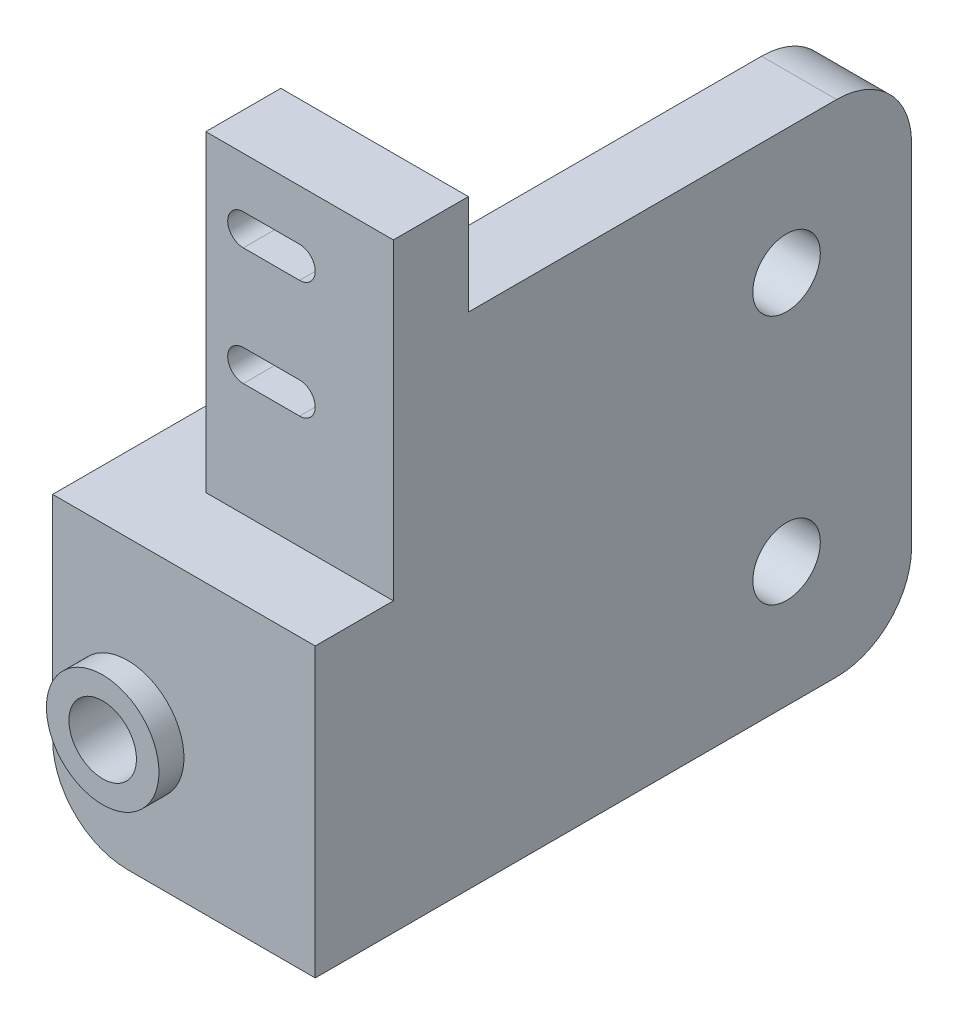
ISO-10303-21;
HEADER;
FILE_DESCRIPTION(('STEP AP214'),'2;1');
FILE_NAME('part.step','',(''),(''),'','','');
FILE_SCHEMA(('AUTOMOTIVE_DESIGN { 1 0 10303 214 1 1 1 1 }'));
ENDSEC;
DATA;
#1=APPLICATION_CONTEXT('core data for automotive mechanical design processes');
#2=APPLICATION_PROTOCOL_DEFINITION('international standard','automotive_design',2000,#1);
#3=PRODUCT_CONTEXT('',#1,'mechanical');
#4=PRODUCT('Part','Part','',(#3));
#5=PRODUCT_RELATED_PRODUCT_CATEGORY('part','',(#4));
#6=PRODUCT_DEFINITION_FORMATION('','',#4);
#7=PRODUCT_DEFINITION_CONTEXT('part definition',#1,'design');
#8=PRODUCT_DEFINITION('design','',#6,#7);
#9=PRODUCT_DEFINITION_SHAPE('','',#8);
#10=(LENGTH_UNIT() NAMED_UNIT(*) SI_UNIT(.MILLI.,.METRE.));
#11=(NAMED_UNIT(*) PLANE_ANGLE_UNIT() SI_UNIT($,.RADIAN.));
#12=(NAMED_UNIT(*) SI_UNIT($,.STERADIAN.) SOLID_ANGLE_UNIT());
#13=UNCERTAINTY_MEASURE_WITH_UNIT(LENGTH_MEASURE(1.E-05),#10,'distance_accuracy_value','');
#14=(GEOMETRIC_REPRESENTATION_CONTEXT(3) GLOBAL_UNCERTAINTY_ASSIGNED_CONTEXT((#13)) GLOBAL_UNIT_ASSIGNED_CONTEXT((#10,
#11,#12)) REPRESENTATION_CONTEXT('',''));
#15=CARTESIAN_POINT('',(0.,0.,0.));
#16=DIRECTION('',(0.,0.,1.));
#17=DIRECTION('',(1.,0.,0.));
#18=AXIS2_PLACEMENT_3D('',#15,#16,#17);
#19=CARTESIAN_POINT('',(0.,0.,0.));
#20=DIRECTION('',(1.,0.,0.));
#21=DIRECTION('',(0.,0.,-1.));
#22=AXIS2_PLACEMENT_3D('',#19,#20,#21);
#23=PLANE('',#22);
#24=CARTESIAN_POINT('',(0.,10.,-33.15));
#25=DIRECTION('',(1.,0.,0.));
#26=DIRECTION('',(0.,0.,-1.));
#27=AXIS2_PLACEMENT_3D('',#24,#25,#26);
#28=CIRCLE('',#27,2.7);
#29=CARTESIAN_POINT('',(0.,10.,-35.85));
#30=VERTEX_POINT('',#29);
#31=EDGE_CURVE('E382',#30,#30,#28,.F.);
#32=ORIENTED_EDGE('',*,*,#31,.T.);
#33=EDGE_LOOP('',(#32));
#34=FACE_BOUND('',#33,.T.);
#35=CARTESIAN_POINT('',(0.,6.,-37.15));
#36=DIRECTION('',(1.,0.,0.));
#37=DIRECTION('',(0.,0.,-1.));
#38=AXIS2_PLACEMENT_3D('',#35,#36,#37);
#39=CIRCLE('',#38,6.);
#40=CARTESIAN_POINT('',(0.,6.,-43.15));
#41=VERTEX_POINT('',#40);
#42=CARTESIAN_POINT('',(0.,0.,-37.15));
#43=VERTEX_POINT('',#42);
#44=EDGE_CURVE('E256',#41,#43,#39,.F.);
#45=ORIENTED_EDGE('',*,*,#44,.F.);
#46=DIRECTION('',(0.,1.,0.));
#47=VECTOR('',#46,1.);
#48=CARTESIAN_POINT('',(0.,0.,-43.15));
#49=LINE('',#48,#47);
#50=CARTESIAN_POINT('',(0.,34.,-43.15));
#51=VERTEX_POINT('',#50);
#52=EDGE_CURVE('E374',#41,#51,#49,.T.);
#53=ORIENTED_EDGE('',*,*,#52,.T.);
#54=CARTESIAN_POINT('',(0.,34.,-37.15));
#55=DIRECTION('',(1.,0.,0.));
#56=DIRECTION('',(0.,0.,-1.));
#57=AXIS2_PLACEMENT_3D('',#54,#55,#56);
#58=CIRCLE('',#57,6.);
#59=CARTESIAN_POINT('',(0.,40.,-37.15));
#60=VERTEX_POINT('',#59);
#61=EDGE_CURVE('E361',#60,#51,#58,.F.);
#62=ORIENTED_EDGE('',*,*,#61,.F.);
#63=DIRECTION('',(0.,0.,-1.));
#64=VECTOR('',#63,1.);
#65=CARTESIAN_POINT('',(0.,40.,0.));
#66=LINE('',#65,#64);
#67=CARTESIAN_POINT('',(0.,40.,-7.7));
#68=VERTEX_POINT('',#67);
#69=EDGE_CURVE('E241',#68,#60,#66,.T.);
#70=ORIENTED_EDGE('',*,*,#69,.F.);
#71=DIRECTION('',(0.,1.,0.));
#72=VECTOR('',#71,1.);
#73=CARTESIAN_POINT('',(0.,23.,-7.7));
#74=LINE('',#73,#72);
#75=CARTESIAN_POINT('',(0.,48.,-7.7));
#76=VERTEX_POINT('',#75);
#77=EDGE_CURVE('E225',#68,#76,#74,.T.);
#78=ORIENTED_EDGE('',*,*,#77,.T.);
#79=DIRECTION('',(0.,0.,1.));
#80=VECTOR('',#79,1.);
#81=CARTESIAN_POINT('',(0.,48.,-1.7));
#82=LINE('',#81,#80);
#83=CARTESIAN_POINT('',(0.,48.,-1.7));
#84=VERTEX_POINT('',#83);
#85=EDGE_CURVE('E239',#76,#84,#82,.T.);
#86=ORIENTED_EDGE('',*,*,#85,.T.);
#87=DIRECTION('',(0.,-1.,0.));
#88=VECTOR('',#87,1.);
#89=CARTESIAN_POINT('',(0.,23.,-1.7));
#90=LINE('',#89,#88);
#91=CARTESIAN_POINT('',(0.,23.,-1.7));
#92=VERTEX_POINT('',#91);
#93=EDGE_CURVE('E243',#84,#92,#90,.T.);
#94=ORIENTED_EDGE('',*,*,#93,.T.);
#95=DIRECTION('',(0.,0.,1.));
#96=VECTOR('',#95,1.);
#97=CARTESIAN_POINT('',(0.,23.,4.55));
#98=LINE('',#97,#96);
#99=CARTESIAN_POINT('',(0.,23.,4.55));
#100=VERTEX_POINT('',#99);
#101=EDGE_CURVE('E366',#92,#100,#98,.T.);
#102=ORIENTED_EDGE('',*,*,#101,.T.);
#103=DIRECTION('',(0.,-1.,0.));
#104=VECTOR('',#103,1.);
#105=CARTESIAN_POINT('',(0.,23.,4.55));
#106=LINE('',#105,#104);
#107=CARTESIAN_POINT('',(0.,0.,4.55));
#108=VERTEX_POINT('',#107);
#109=EDGE_CURVE('E378',#100,#108,#106,.T.);
#110=ORIENTED_EDGE('',*,*,#109,.T.);
#111=DIRECTION('',(0.,0.,-1.));
#112=VECTOR('',#111,1.);
#113=CARTESIAN_POINT('',(0.,0.,0.));
#114=LINE('',#113,#112);
#115=EDGE_CURVE('E370',#108,#43,#114,.T.);
#116=ORIENTED_EDGE('',*,*,#115,.T.);
#117=EDGE_LOOP('',(#45,#53,#62,#70,#78,#86,#94,#102,#110,#116));
#118=FACE_BOUND('',#117,.T.);
#119=CARTESIAN_POINT('',(0.,30.,-33.15));
#120=DIRECTION('',(1.,0.,0.));
#121=DIRECTION('',(0.,0.,-1.));
#122=AXIS2_PLACEMENT_3D('',#119,#120,#121);
#123=CIRCLE('',#122,2.69999999999999);
#124=CARTESIAN_POINT('',(0.,30.,-35.85));
#125=VERTEX_POINT('',#124);
#126=EDGE_CURVE('E386',#125,#125,#123,.F.);
#127=ORIENTED_EDGE('',*,*,#126,.T.);
#128=EDGE_LOOP('',(#127));
#129=FACE_BOUND('',#128,.T.);
#130=ADVANCED_FACE('F41',(#34,#118,#129),#23,.T.);
#131=CARTESIAN_POINT('',(6.,40.,0.));
#132=DIRECTION('',(0.,1.,0.));
#133=DIRECTION('',(0.,0.,1.));
#134=AXIS2_PLACEMENT_3D('',#131,#132,#133);
#135=PLANE('',#134);
#136=DIRECTION('',(1.,0.,0.));
#137=VECTOR('',#136,1.);
#138=CARTESIAN_POINT('',(6.,40.,-7.7));
#139=LINE('',#138,#137);
#140=CARTESIAN_POINT('',(-6.,40.,-7.7));
#141=VERTEX_POINT('',#140);
#142=EDGE_CURVE('E233',#141,#68,#139,.T.);
#143=ORIENTED_EDGE('',*,*,#142,.T.);
#144=ORIENTED_EDGE('',*,*,#69,.T.);
#145=DIRECTION('',(-1.,0.,0.));
#146=VECTOR('',#145,1.);
#147=CARTESIAN_POINT('',(0.,40.,-37.15));
#148=LINE('',#147,#146);
#149=CARTESIAN_POINT('',(-6.,40.,-37.15));
#150=VERTEX_POINT('',#149);
#151=EDGE_CURVE('E263',#60,#150,#148,.T.);
#152=ORIENTED_EDGE('',*,*,#151,.T.);
#153=DIRECTION('',(0.,0.,-1.));
#154=VECTOR('',#153,1.);
#155=CARTESIAN_POINT('',(-6.,40.,0.));
#156=LINE('',#155,#154);
#157=EDGE_CURVE('E281',#141,#150,#156,.T.);
#158=ORIENTED_EDGE('',*,*,#157,.F.);
#159=EDGE_LOOP('',(#143,#144,#152,#158));
#160=FACE_BOUND('',#159,.T.);
#161=ADVANCED_FACE('F278',(#160),#135,.T.);
#162=CARTESIAN_POINT('',(21.,23.,4.55));
#163=DIRECTION('',(0.,-1.,0.));
#164=DIRECTION('',(0.,0.,-1.));
#165=AXIS2_PLACEMENT_3D('',#162,#163,#164);
#166=PLANE('',#165);
#167=ORIENTED_EDGE('',*,*,#101,.F.);
#168=DIRECTION('',(1.,0.,0.));
#169=VECTOR('',#168,1.);
#170=CARTESIAN_POINT('',(0.,23.,-1.7));
#171=LINE('',#170,#169);
#172=CARTESIAN_POINT('',(-15.,23.,-1.7));
#173=VERTEX_POINT('',#172);
#174=EDGE_CURVE('E272',#173,#92,#171,.T.);
#175=ORIENTED_EDGE('',*,*,#174,.F.);
#176=DIRECTION('',(0.,0.,-1.));
#177=VECTOR('',#176,1.);
#178=CARTESIAN_POINT('',(-15.,23.,-1.7));
#179=LINE('',#178,#177);
#180=CARTESIAN_POINT('',(-15.,23.,-7.7));
#181=VERTEX_POINT('',#180);
#182=EDGE_CURVE('E305',#173,#181,#179,.T.);
#183=ORIENTED_EDGE('',*,*,#182,.T.);
#184=DIRECTION('',(1.,0.,0.));
#185=VECTOR('',#184,1.);
#186=CARTESIAN_POINT('',(-15.,23.,-7.7));
#187=LINE('',#186,#185);
#188=CARTESIAN_POINT('',(-6.,23.,-7.7));
#189=VERTEX_POINT('',#188);
#190=EDGE_CURVE('E285',#181,#189,#187,.T.);
#191=ORIENTED_EDGE('',*,*,#190,.T.);
#192=DIRECTION('',(0.,0.,1.));
#193=VECTOR('',#192,1.);
#194=CARTESIAN_POINT('',(-6.,23.,0.));
#195=LINE('',#194,#193);
#196=CARTESIAN_POINT('',(-6.,23.,-43.15));
#197=VERTEX_POINT('',#196);
#198=EDGE_CURVE('E472',#197,#189,#195,.T.);
#199=ORIENTED_EDGE('',*,*,#198,.F.);
#200=DIRECTION('',(1.,0.,0.));
#201=VECTOR('',#200,1.);
#202=CARTESIAN_POINT('',(-21.,23.,-43.15));
#203=LINE('',#202,#201);
#204=CARTESIAN_POINT('',(-9.99999999999999,23.,-43.15));
#205=VERTEX_POINT('',#204);
#206=EDGE_CURVE('E470',#205,#197,#203,.T.);
#207=ORIENTED_EDGE('',*,*,#206,.F.);
#208=DIRECTION('',(0.330149880798441,0.,-0.943928522828278));
#209=VECTOR('',#208,1.);
#210=CARTESIAN_POINT('',(-21.,23.,-11.6999999999997));
#211=LINE('',#210,#209);
#212=CARTESIAN_POINT('',(-21.,23.,-11.6999999999997));
#213=VERTEX_POINT('',#212);
#214=EDGE_CURVE('E538',#213,#205,#211,.T.);
#215=ORIENTED_EDGE('',*,*,#214,.F.);
#216=DIRECTION('',(0.,0.,1.));
#217=VECTOR('',#216,1.);
#218=CARTESIAN_POINT('',(-21.,23.,-1.45));
#219=LINE('',#218,#217);
#220=CARTESIAN_POINT('',(-21.,23.,4.55));
#221=VERTEX_POINT('',#220);
#222=EDGE_CURVE('E401',#213,#221,#219,.T.);
#223=ORIENTED_EDGE('',*,*,#222,.T.);
#224=DIRECTION('',(-1.,0.,0.));
#225=VECTOR('',#224,1.);
#226=CARTESIAN_POINT('',(21.,23.,4.55));
#227=LINE('',#226,#225);
#228=EDGE_CURVE('E269',#100,#221,#227,.T.);
#229=ORIENTED_EDGE('',*,*,#228,.F.);
#230=EDGE_LOOP('',(#167,#175,#183,#191,#199,#207,#215,#223,#229));
#231=FACE_BOUND('',#230,.T.);
#232=ADVANCED_FACE('F397',(#231),#166,.F.);
#233=CARTESIAN_POINT('',(6.,0.,0.));
#234=DIRECTION('',(0.,1.,0.));
#235=DIRECTION('',(0.,0.,1.));
#236=AXIS2_PLACEMENT_3D('',#233,#234,#235);
#237=PLANE('',#236);
#238=ORIENTED_EDGE('',*,*,#115,.F.);
#239=DIRECTION('',(-1.,0.,0.));
#240=VECTOR('',#239,1.);
#241=CARTESIAN_POINT('',(21.,0.,4.55));
#242=LINE('',#241,#240);
#243=CARTESIAN_POINT('',(-15.,0.,4.55));
#244=VERTEX_POINT('',#243);
#245=EDGE_CURVE('E266',#108,#244,#242,.T.);
#246=ORIENTED_EDGE('',*,*,#245,.T.);
#247=DIRECTION('',(0.,0.,-1.));
#248=VECTOR('',#247,1.);
#249=CARTESIAN_POINT('',(-15.,0.,4.55));
#250=LINE('',#249,#248);
#251=CARTESIAN_POINT('',(-15.,0.,-1.45));
#252=VERTEX_POINT('',#251);
#253=EDGE_CURVE('E519',#252,#244,#250,.F.);
#254=ORIENTED_EDGE('',*,*,#253,.F.);
#255=DIRECTION('',(1.,0.,0.));
#256=VECTOR('',#255,1.);
#257=CARTESIAN_POINT('',(-21.,0.,-1.45));
#258=LINE('',#257,#256);
#259=CARTESIAN_POINT('',(-6.,0.,-1.45));
#260=VERTEX_POINT('',#259);
#261=EDGE_CURVE('E466',#252,#260,#258,.T.);
#262=ORIENTED_EDGE('',*,*,#261,.T.);
#263=DIRECTION('',(0.,0.,-1.));
#264=VECTOR('',#263,1.);
#265=CARTESIAN_POINT('',(-6.,0.,0.));
#266=LINE('',#265,#264);
#267=CARTESIAN_POINT('',(-6.,0.,-37.15));
#268=VERTEX_POINT('',#267);
#269=EDGE_CURVE('E504',#260,#268,#266,.T.);
#270=ORIENTED_EDGE('',*,*,#269,.T.);
#271=DIRECTION('',(-1.,0.,0.));
#272=VECTOR('',#271,1.);
#273=CARTESIAN_POINT('',(6.,0.,-37.15));
#274=LINE('',#273,#272);
#275=EDGE_CURVE('E251',#268,#43,#274,.F.);
#276=ORIENTED_EDGE('',*,*,#275,.T.);
#277=EDGE_LOOP('',(#238,#246,#254,#262,#270,#276));
#278=FACE_BOUND('',#277,.T.);
#279=ADVANCED_FACE('F521',(#278),#237,.F.);
#280=CARTESIAN_POINT('',(6.,0.,-43.15));
#281=DIRECTION('',(0.,0.,1.));
#282=DIRECTION('',(1.,0.,0.));
#283=AXIS2_PLACEMENT_3D('',#280,#281,#282);
#284=PLANE('',#283);
#285=ORIENTED_EDGE('',*,*,#52,.F.);
#286=DIRECTION('',(-1.,0.,0.));
#287=VECTOR('',#286,1.);
#288=CARTESIAN_POINT('',(6.,6.,-43.15));
#289=LINE('',#288,#287);
#290=CARTESIAN_POINT('',(-6.,6.,-43.15));
#291=VERTEX_POINT('',#290);
#292=EDGE_CURVE('E260',#41,#291,#289,.T.);
#293=ORIENTED_EDGE('',*,*,#292,.T.);
#294=DIRECTION('',(0.,1.,0.));
#295=VECTOR('',#294,1.);
#296=CARTESIAN_POINT('',(-6.,0.,-43.15));
#297=LINE('',#296,#295);
#298=CARTESIAN_POINT('',(-6.,17.,-43.15));
#299=VERTEX_POINT('',#298);
#300=EDGE_CURVE('E497',#291,#299,#297,.T.);
#301=ORIENTED_EDGE('',*,*,#300,.T.);
#302=DIRECTION('',(1.,0.,0.));
#303=VECTOR('',#302,1.);
#304=CARTESIAN_POINT('',(-21.,17.,-43.15));
#305=LINE('',#304,#303);
#306=CARTESIAN_POINT('',(-9.99999999999999,17.,-43.15));
#307=VERTEX_POINT('',#306);
#308=EDGE_CURVE('E465',#307,#299,#305,.T.);
#309=ORIENTED_EDGE('',*,*,#308,.F.);
#310=DIRECTION('',(0.,-1.,0.));
#311=VECTOR('',#310,1.);
#312=CARTESIAN_POINT('',(-9.99999999999999,17.,-43.15));
#313=LINE('',#312,#311);
#314=EDGE_CURVE('E490',#205,#307,#313,.T.);
#315=ORIENTED_EDGE('',*,*,#314,.F.);
#316=ORIENTED_EDGE('',*,*,#206,.T.);
#317=CARTESIAN_POINT('',(-6.,34.,-43.15));
#318=VERTEX_POINT('',#317);
#319=EDGE_CURVE('E486',#197,#318,#297,.T.);
#320=ORIENTED_EDGE('',*,*,#319,.T.);
#321=DIRECTION('',(-1.,0.,0.));
#322=VECTOR('',#321,1.);
#323=CARTESIAN_POINT('',(6.,34.,-43.15));
#324=LINE('',#323,#322);
#325=EDGE_CURVE('E255',#318,#51,#324,.F.);
#326=ORIENTED_EDGE('',*,*,#325,.T.);
#327=EDGE_LOOP('',(#285,#293,#301,#309,#315,#316,#320,#326));
#328=FACE_BOUND('',#327,.T.);
#329=ADVANCED_FACE('F484',(#328),#284,.F.);
#330=CARTESIAN_POINT('',(21.,23.,4.55));
#331=DIRECTION('',(0.,0.,-1.));
#332=DIRECTION('',(0.,1.,0.));
#333=AXIS2_PLACEMENT_3D('',#330,#331,#332);
#334=PLANE('',#333);
#335=CARTESIAN_POINT('',(-15.,10.,4.55));
#336=DIRECTION('',(0.,0.,-1.));
#337=DIRECTION('',(-1.,0.,0.));
#338=AXIS2_PLACEMENT_3D('',#335,#336,#337);
#339=CIRCLE('',#338,4.5);
#340=CARTESIAN_POINT('',(-19.5,10.,4.55));
#341=VERTEX_POINT('',#340);
#342=EDGE_CURVE('E430',#341,#341,#339,.T.);
#343=ORIENTED_EDGE('',*,*,#342,.T.);
#344=EDGE_LOOP('',(#343));
#345=FACE_BOUND('',#344,.T.);
#346=ORIENTED_EDGE('',*,*,#109,.F.);
#347=ORIENTED_EDGE('',*,*,#228,.T.);
#348=DIRECTION('',(0.,-1.,0.));
#349=VECTOR('',#348,1.);
#350=CARTESIAN_POINT('',(-21.,23.,4.55));
#351=LINE('',#350,#349);
#352=CARTESIAN_POINT('',(-21.,6.,4.55));
#353=VERTEX_POINT('',#352);
#354=EDGE_CURVE('E406',#221,#353,#351,.T.);
#355=ORIENTED_EDGE('',*,*,#354,.T.);
#356=CARTESIAN_POINT('',(-15.,6.,4.55));
#357=DIRECTION('',(0.,0.,1.));
#358=DIRECTION('',(0.,1.,0.));
#359=AXIS2_PLACEMENT_3D('',#356,#357,#358);
#360=CIRCLE('',#359,6.);
#361=EDGE_CURVE('E524',#244,#353,#360,.F.);
#362=ORIENTED_EDGE('',*,*,#361,.F.);
#363=ORIENTED_EDGE('',*,*,#245,.F.);
#364=EDGE_LOOP('',(#346,#347,#355,#362,#363));
#365=FACE_BOUND('',#364,.T.);
#366=ADVANCED_FACE('F43',(#345,#365),#334,.F.);
#367=CARTESIAN_POINT('',(0.,10.,-33.15));
#368=DIRECTION('',(-1.,0.,0.));
#369=DIRECTION('',(0.,0.,1.));
#370=AXIS2_PLACEMENT_3D('',#367,#368,#369);
#371=CYLINDRICAL_SURFACE('',#370,2.7);
#372=CARTESIAN_POINT('',(-6.,10.,-33.15));
#373=DIRECTION('',(-1.,0.,0.));
#374=DIRECTION('',(0.,0.,1.));
#375=AXIS2_PLACEMENT_3D('',#372,#373,#374);
#376=CIRCLE('',#375,2.7);
#377=CARTESIAN_POINT('',(-6.,10.,-30.45));
#378=VERTEX_POINT('',#377);
#379=EDGE_CURVE('E413',#378,#378,#376,.T.);
#380=ORIENTED_EDGE('',*,*,#379,.T.);
#381=EDGE_LOOP('',(#380));
#382=FACE_BOUND('',#381,.T.);
#383=ORIENTED_EDGE('',*,*,#31,.F.);
#384=EDGE_LOOP('',(#383));
#385=FACE_BOUND('',#384,.T.);
#386=ADVANCED_FACE('F626',(#382,#385),#371,.F.);
#387=CARTESIAN_POINT('',(0.,30.,-33.15));
#388=DIRECTION('',(-1.,0.,0.));
#389=DIRECTION('',(0.,0.,1.));
#390=AXIS2_PLACEMENT_3D('',#387,#388,#389);
#391=CYLINDRICAL_SURFACE('',#390,2.69999999999999);
#392=CARTESIAN_POINT('',(-6.,30.,-33.15));
#393=DIRECTION('',(-1.,0.,0.));
#394=DIRECTION('',(0.,0.,1.));
#395=AXIS2_PLACEMENT_3D('',#392,#393,#394);
#396=CIRCLE('',#395,2.69999999999999);
#397=CARTESIAN_POINT('',(-6.,30.,-30.45));
#398=VERTEX_POINT('',#397);
#399=EDGE_CURVE('E419',#398,#398,#396,.T.);
#400=ORIENTED_EDGE('',*,*,#399,.T.);
#401=EDGE_LOOP('',(#400));
#402=FACE_BOUND('',#401,.T.);
#403=ORIENTED_EDGE('',*,*,#126,.F.);
#404=EDGE_LOOP('',(#403));
#405=FACE_BOUND('',#404,.T.);
#406=ADVANCED_FACE('F623',(#402,#405),#391,.F.);
#407=CARTESIAN_POINT('',(6.,34.,-37.15));
#408=DIRECTION('',(1.,0.,0.));
#409=DIRECTION('',(0.,0.,-1.));
#410=AXIS2_PLACEMENT_3D('',#407,#408,#409);
#411=CYLINDRICAL_SURFACE('',#410,6.);
#412=ORIENTED_EDGE('',*,*,#151,.F.);
#413=ORIENTED_EDGE('',*,*,#61,.T.);
#414=ORIENTED_EDGE('',*,*,#325,.F.);
#415=CARTESIAN_POINT('',(-6.,34.,-37.15));
#416=DIRECTION('',(-1.,0.,0.));
#417=DIRECTION('',(0.,0.,1.));
#418=AXIS2_PLACEMENT_3D('',#415,#416,#417);
#419=CIRCLE('',#418,6.);
#420=EDGE_CURVE('E495',#318,#150,#419,.F.);
#421=ORIENTED_EDGE('',*,*,#420,.T.);
#422=EDGE_LOOP('',(#412,#413,#414,#421));
#423=FACE_BOUND('',#422,.T.);
#424=ADVANCED_FACE('F620',(#423),#411,.T.);
#425=CARTESIAN_POINT('',(6.,6.,-37.15));
#426=DIRECTION('',(-1.,0.,0.));
#427=DIRECTION('',(0.,0.,1.));
#428=AXIS2_PLACEMENT_3D('',#425,#426,#427);
#429=CYLINDRICAL_SURFACE('',#428,6.);
#430=ORIENTED_EDGE('',*,*,#292,.F.);
#431=ORIENTED_EDGE('',*,*,#44,.T.);
#432=ORIENTED_EDGE('',*,*,#275,.F.);
#433=CARTESIAN_POINT('',(-6.,6.,-37.15));
#434=DIRECTION('',(-1.,0.,0.));
#435=DIRECTION('',(0.,0.,1.));
#436=AXIS2_PLACEMENT_3D('',#433,#434,#435);
#437=CIRCLE('',#436,6.);
#438=EDGE_CURVE('E547',#268,#291,#437,.F.);
#439=ORIENTED_EDGE('',*,*,#438,.T.);
#440=EDGE_LOOP('',(#430,#431,#432,#439));
#441=FACE_BOUND('',#440,.T.);
#442=ADVANCED_FACE('F546',(#441),#429,.T.);
#443=CARTESIAN_POINT('',(0.,23.,-1.7));
#444=DIRECTION('',(0.,0.,-1.));
#445=DIRECTION('',(-1.,0.,0.));
#446=AXIS2_PLACEMENT_3D('',#443,#444,#445);
#447=PLANE('',#446);
#448=DIRECTION('',(1.,0.,0.));
#449=VECTOR('',#448,1.);
#450=CARTESIAN_POINT('',(-12.,34.55,-1.7));
#451=LINE('',#450,#449);
#452=CARTESIAN_POINT('',(-12.,34.55,-1.7));
#453=VERTEX_POINT('',#452);
#454=CARTESIAN_POINT('',(-7.5,34.55,-1.7));
#455=VERTEX_POINT('',#454);
#456=EDGE_CURVE('E52',#453,#455,#451,.T.);
#457=ORIENTED_EDGE('',*,*,#456,.T.);
#458=CARTESIAN_POINT('',(-7.5,33.3,-1.7));
#459=DIRECTION('',(0.,0.,-1.));
#460=DIRECTION('',(-1.,0.,0.));
#461=AXIS2_PLACEMENT_3D('',#458,#459,#460);
#462=CIRCLE('',#461,1.25);
#463=CARTESIAN_POINT('',(-7.5,32.05,-1.7));
#464=VERTEX_POINT('',#463);
#465=EDGE_CURVE('E328',#455,#464,#462,.T.);
#466=ORIENTED_EDGE('',*,*,#465,.T.);
#467=DIRECTION('',(-1.,0.,0.));
#468=VECTOR('',#467,1.);
#469=CARTESIAN_POINT('',(-12.,32.05,-1.7));
#470=LINE('',#469,#468);
#471=CARTESIAN_POINT('',(-12.,32.05,-1.7));
#472=VERTEX_POINT('',#471);
#473=EDGE_CURVE('E316',#464,#472,#470,.T.);
#474=ORIENTED_EDGE('',*,*,#473,.T.);
#475=CARTESIAN_POINT('',(-12.,33.3,-1.7));
#476=DIRECTION('',(0.,0.,-1.));
#477=DIRECTION('',(-1.,0.,0.));
#478=AXIS2_PLACEMENT_3D('',#475,#476,#477);
#479=CIRCLE('',#478,1.25);
#480=EDGE_CURVE('E11',#472,#453,#479,.T.);
#481=ORIENTED_EDGE('',*,*,#480,.T.);
#482=EDGE_LOOP('',(#457,#466,#474,#481));
#483=FACE_BOUND('',#482,.T.);
#484=DIRECTION('',(1.,0.,0.));
#485=VECTOR('',#484,1.);
#486=CARTESIAN_POINT('',(-12.,43.95,-1.7));
#487=LINE('',#486,#485);
#488=CARTESIAN_POINT('',(-12.,43.95,-1.7));
#489=VERTEX_POINT('',#488);
#490=CARTESIAN_POINT('',(-7.5,43.95,-1.7));
#491=VERTEX_POINT('',#490);
#492=EDGE_CURVE('E352',#489,#491,#487,.T.);
#493=ORIENTED_EDGE('',*,*,#492,.T.);
#494=CARTESIAN_POINT('',(-7.5,42.7,-1.7));
#495=DIRECTION('',(0.,0.,-1.));
#496=DIRECTION('',(-1.,0.,0.));
#497=AXIS2_PLACEMENT_3D('',#494,#495,#496);
#498=CIRCLE('',#497,1.25);
#499=CARTESIAN_POINT('',(-7.5,41.45,-1.7));
#500=VERTEX_POINT('',#499);
#501=EDGE_CURVE('E348',#491,#500,#498,.T.);
#502=ORIENTED_EDGE('',*,*,#501,.T.);
#503=DIRECTION('',(-1.,0.,0.));
#504=VECTOR('',#503,1.);
#505=CARTESIAN_POINT('',(-12.,41.45,-1.7));
#506=LINE('',#505,#504);
#507=CARTESIAN_POINT('',(-12.,41.45,-1.7));
#508=VERTEX_POINT('',#507);
#509=EDGE_CURVE('E338',#500,#508,#506,.T.);
#510=ORIENTED_EDGE('',*,*,#509,.T.);
#511=CARTESIAN_POINT('',(-12.,42.7,-1.7));
#512=DIRECTION('',(0.,0.,-1.));
#513=DIRECTION('',(-1.,0.,0.));
#514=AXIS2_PLACEMENT_3D('',#511,#512,#513);
#515=CIRCLE('',#514,1.25);
#516=EDGE_CURVE('E324',#508,#489,#515,.T.);
#517=ORIENTED_EDGE('',*,*,#516,.T.);
#518=EDGE_LOOP('',(#493,#502,#510,#517));
#519=FACE_BOUND('',#518,.T.);
#520=ORIENTED_EDGE('',*,*,#93,.F.);
#521=DIRECTION('',(-1.,0.,0.));
#522=VECTOR('',#521,1.);
#523=CARTESIAN_POINT('',(15.,48.,-1.7));
#524=LINE('',#523,#522);
#525=CARTESIAN_POINT('',(-15.,48.,-1.7));
#526=VERTEX_POINT('',#525);
#527=EDGE_CURVE('E45',#84,#526,#524,.T.);
#528=ORIENTED_EDGE('',*,*,#527,.T.);
#529=DIRECTION('',(0.,-1.,0.));
#530=VECTOR('',#529,1.);
#531=CARTESIAN_POINT('',(-15.,23.,-1.7));
#532=LINE('',#531,#530);
#533=EDGE_CURVE('E308',#526,#173,#532,.T.);
#534=ORIENTED_EDGE('',*,*,#533,.T.);
#535=ORIENTED_EDGE('',*,*,#174,.T.);
#536=EDGE_LOOP('',(#520,#528,#534,#535));
#537=FACE_BOUND('',#536,.T.);
#538=ADVANCED_FACE('F393',(#483,#519,#537),#447,.F.);
#539=CARTESIAN_POINT('',(15.,23.,-7.7));
#540=DIRECTION('',(0.,0.,1.));
#541=DIRECTION('',(1.,0.,0.));
#542=AXIS2_PLACEMENT_3D('',#539,#540,#541);
#543=PLANE('',#542);
#544=DIRECTION('',(-1.,0.,0.));
#545=VECTOR('',#544,1.);
#546=CARTESIAN_POINT('',(-15.,32.05,-7.7));
#547=LINE('',#546,#545);
#548=CARTESIAN_POINT('',(-7.5,32.05,-7.7));
#549=VERTEX_POINT('',#548);
#550=CARTESIAN_POINT('',(-12.,32.05,-7.7));
#551=VERTEX_POINT('',#550);
#552=EDGE_CURVE('E559',#549,#551,#547,.T.);
#553=ORIENTED_EDGE('',*,*,#552,.F.);
#554=CARTESIAN_POINT('',(-7.5,33.3,-7.7));
#555=DIRECTION('',(0.,0.,-1.));
#556=DIRECTION('',(-1.,0.,0.));
#557=AXIS2_PLACEMENT_3D('',#554,#555,#556);
#558=CIRCLE('',#557,1.25);
#559=CARTESIAN_POINT('',(-7.5,34.55,-7.7));
#560=VERTEX_POINT('',#559);
#561=EDGE_CURVE('E553',#560,#549,#558,.T.);
#562=ORIENTED_EDGE('',*,*,#561,.F.);
#563=DIRECTION('',(1.,0.,0.));
#564=VECTOR('',#563,1.);
#565=CARTESIAN_POINT('',(-15.,34.55,-7.7));
#566=LINE('',#565,#564);
#567=CARTESIAN_POINT('',(-12.,34.55,-7.7));
#568=VERTEX_POINT('',#567);
#569=EDGE_CURVE('E549',#568,#560,#566,.T.);
#570=ORIENTED_EDGE('',*,*,#569,.F.);
#571=CARTESIAN_POINT('',(-12.,33.3,-7.7));
#572=DIRECTION('',(0.,0.,-1.));
#573=DIRECTION('',(-1.,0.,0.));
#574=AXIS2_PLACEMENT_3D('',#571,#572,#573);
#575=CIRCLE('',#574,1.25);
#576=EDGE_CURVE('E562',#551,#568,#575,.T.);
#577=ORIENTED_EDGE('',*,*,#576,.F.);
#578=EDGE_LOOP('',(#553,#562,#570,#577));
#579=FACE_BOUND('',#578,.T.);
#580=DIRECTION('',(-1.,0.,0.));
#581=VECTOR('',#580,1.);
#582=CARTESIAN_POINT('',(-15.,41.45,-7.7));
#583=LINE('',#582,#581);
#584=CARTESIAN_POINT('',(-7.5,41.45,-7.7));
#585=VERTEX_POINT('',#584);
#586=CARTESIAN_POINT('',(-12.,41.45,-7.7));
#587=VERTEX_POINT('',#586);
#588=EDGE_CURVE('E572',#585,#587,#583,.T.);
#589=ORIENTED_EDGE('',*,*,#588,.F.);
#590=CARTESIAN_POINT('',(-7.5,42.7,-7.7));
#591=DIRECTION('',(0.,0.,-1.));
#592=DIRECTION('',(-1.,0.,0.));
#593=AXIS2_PLACEMENT_3D('',#590,#591,#592);
#594=CIRCLE('',#593,1.25);
#595=CARTESIAN_POINT('',(-7.5,43.95,-7.7));
#596=VERTEX_POINT('',#595);
#597=EDGE_CURVE('E569',#596,#585,#594,.T.);
#598=ORIENTED_EDGE('',*,*,#597,.F.);
#599=DIRECTION('',(1.,0.,0.));
#600=VECTOR('',#599,1.);
#601=CARTESIAN_POINT('',(-15.,43.95,-7.7));
#602=LINE('',#601,#600);
#603=CARTESIAN_POINT('',(-12.,43.95,-7.7));
#604=VERTEX_POINT('',#603);
#605=EDGE_CURVE('E566',#604,#596,#602,.T.);
#606=ORIENTED_EDGE('',*,*,#605,.F.);
#607=CARTESIAN_POINT('',(-12.,42.7,-7.7));
#608=DIRECTION('',(0.,0.,-1.));
#609=DIRECTION('',(-1.,0.,0.));
#610=AXIS2_PLACEMENT_3D('',#607,#608,#609);
#611=CIRCLE('',#610,1.25);
#612=EDGE_CURVE('E576',#587,#604,#611,.T.);
#613=ORIENTED_EDGE('',*,*,#612,.F.);
#614=EDGE_LOOP('',(#589,#598,#606,#613));
#615=FACE_BOUND('',#614,.T.);
#616=ORIENTED_EDGE('',*,*,#77,.F.);
#617=ORIENTED_EDGE('',*,*,#142,.F.);
#618=DIRECTION('',(0.,1.,0.));
#619=VECTOR('',#618,1.);
#620=CARTESIAN_POINT('',(-6.,0.,-7.7));
#621=LINE('',#620,#619);
#622=EDGE_CURVE('E284',#189,#141,#621,.T.);
#623=ORIENTED_EDGE('',*,*,#622,.F.);
#624=ORIENTED_EDGE('',*,*,#190,.F.);
#625=DIRECTION('',(0.,1.,0.));
#626=VECTOR('',#625,1.);
#627=CARTESIAN_POINT('',(-15.,23.,-7.7));
#628=LINE('',#627,#626);
#629=CARTESIAN_POINT('',(-15.,48.,-7.7));
#630=VERTEX_POINT('',#629);
#631=EDGE_CURVE('E227',#181,#630,#628,.T.);
#632=ORIENTED_EDGE('',*,*,#631,.T.);
#633=DIRECTION('',(-1.,0.,0.));
#634=VECTOR('',#633,1.);
#635=CARTESIAN_POINT('',(15.,48.,-7.7));
#636=LINE('',#635,#634);
#637=EDGE_CURVE('E222',#76,#630,#636,.T.);
#638=ORIENTED_EDGE('',*,*,#637,.F.);
#639=EDGE_LOOP('',(#616,#617,#623,#624,#632,#638));
#640=FACE_BOUND('',#639,.T.);
#641=ADVANCED_FACE('F224',(#579,#615,#640),#543,.F.);
#642=CARTESIAN_POINT('',(15.,48.,-1.7));
#643=DIRECTION('',(0.,-1.,0.));
#644=DIRECTION('',(0.,0.,-1.));
#645=AXIS2_PLACEMENT_3D('',#642,#643,#644);
#646=PLANE('',#645);
#647=ORIENTED_EDGE('',*,*,#85,.F.);
#648=ORIENTED_EDGE('',*,*,#637,.T.);
#649=DIRECTION('',(0.,0.,1.));
#650=VECTOR('',#649,1.);
#651=CARTESIAN_POINT('',(-15.,48.,-1.7));
#652=LINE('',#651,#650);
#653=EDGE_CURVE('E294',#630,#526,#652,.T.);
#654=ORIENTED_EDGE('',*,*,#653,.T.);
#655=ORIENTED_EDGE('',*,*,#527,.F.);
#656=EDGE_LOOP('',(#647,#648,#654,#655));
#657=FACE_BOUND('',#656,.T.);
#658=ADVANCED_FACE('F245',(#657),#646,.F.);
#659=CARTESIAN_POINT('',(-6.,0.,0.));
#660=DIRECTION('',(1.,0.,0.));
#661=DIRECTION('',(0.,0.,1.));
#662=AXIS2_PLACEMENT_3D('',#659,#660,#661);
#663=PLANE('',#662);
#664=ORIENTED_EDGE('',*,*,#399,.F.);
#665=EDGE_LOOP('',(#664));
#666=FACE_BOUND('',#665,.T.);
#667=ORIENTED_EDGE('',*,*,#622,.T.);
#668=ORIENTED_EDGE('',*,*,#157,.T.);
#669=ORIENTED_EDGE('',*,*,#420,.F.);
#670=ORIENTED_EDGE('',*,*,#319,.F.);
#671=ORIENTED_EDGE('',*,*,#198,.T.);
#672=EDGE_LOOP('',(#667,#668,#669,#670,#671));
#673=FACE_BOUND('',#672,.T.);
#674=ADVANCED_FACE('F493',(#666,#673),#663,.F.);
#675=ORIENTED_EDGE('',*,*,#379,.F.);
#676=EDGE_LOOP('',(#675));
#677=FACE_BOUND('',#676,.T.);
#678=ORIENTED_EDGE('',*,*,#269,.F.);
#679=DIRECTION('',(0.,1.,0.));
#680=VECTOR('',#679,1.);
#681=CARTESIAN_POINT('',(-6.,0.,-1.45));
#682=LINE('',#681,#680);
#683=CARTESIAN_POINT('',(-6.,17.,-1.45));
#684=VERTEX_POINT('',#683);
#685=EDGE_CURVE('E501',#260,#684,#682,.T.);
#686=ORIENTED_EDGE('',*,*,#685,.T.);
#687=DIRECTION('',(0.,0.,-1.));
#688=VECTOR('',#687,1.);
#689=CARTESIAN_POINT('',(-6.,17.,0.));
#690=LINE('',#689,#688);
#691=EDGE_CURVE('E462',#684,#299,#690,.T.);
#692=ORIENTED_EDGE('',*,*,#691,.T.);
#693=ORIENTED_EDGE('',*,*,#300,.F.);
#694=ORIENTED_EDGE('',*,*,#438,.F.);
#695=EDGE_LOOP('',(#678,#686,#692,#693,#694));
#696=FACE_BOUND('',#695,.T.);
#697=ADVANCED_FACE('F447',(#677,#696),#663,.F.);
#698=CARTESIAN_POINT('',(-21.,17.,-1.45));
#699=DIRECTION('',(0.,0.,1.));
#700=DIRECTION('',(0.,-1.,0.));
#701=AXIS2_PLACEMENT_3D('',#698,#699,#700);
#702=PLANE('',#701);
#703=CARTESIAN_POINT('',(-15.,10.,-1.45));
#704=DIRECTION('',(0.,0.,-1.));
#705=DIRECTION('',(0.,-1.,0.));
#706=AXIS2_PLACEMENT_3D('',#703,#704,#705);
#707=CIRCLE('',#706,2.69999999999999);
#708=CARTESIAN_POINT('',(-15.,7.30000000000001,-1.45));
#709=VERTEX_POINT('',#708);
#710=EDGE_CURVE('E297',#709,#709,#707,.T.);
#711=ORIENTED_EDGE('',*,*,#710,.F.);
#712=EDGE_LOOP('',(#711));
#713=FACE_BOUND('',#712,.T.);
#714=DIRECTION('',(0.,1.,0.));
#715=VECTOR('',#714,1.);
#716=CARTESIAN_POINT('',(-21.,17.,-1.45));
#717=LINE('',#716,#715);
#718=CARTESIAN_POINT('',(-21.,6.,-1.45));
#719=VERTEX_POINT('',#718);
#720=CARTESIAN_POINT('',(-21.,17.,-1.45));
#721=VERTEX_POINT('',#720);
#722=EDGE_CURVE('E414',#719,#721,#717,.T.);
#723=ORIENTED_EDGE('',*,*,#722,.T.);
#724=DIRECTION('',(1.,0.,0.));
#725=VECTOR('',#724,1.);
#726=CARTESIAN_POINT('',(-21.,17.,-1.45));
#727=LINE('',#726,#725);
#728=EDGE_CURVE('E452',#721,#684,#727,.T.);
#729=ORIENTED_EDGE('',*,*,#728,.T.);
#730=ORIENTED_EDGE('',*,*,#685,.F.);
#731=ORIENTED_EDGE('',*,*,#261,.F.);
#732=CARTESIAN_POINT('',(-15.,6.,-1.45));
#733=DIRECTION('',(0.,0.,-1.));
#734=DIRECTION('',(0.,-1.,0.));
#735=AXIS2_PLACEMENT_3D('',#732,#733,#734);
#736=CIRCLE('',#735,6.);
#737=EDGE_CURVE('E455',#719,#252,#736,.F.);
#738=ORIENTED_EDGE('',*,*,#737,.F.);
#739=EDGE_LOOP('',(#723,#729,#730,#731,#738));
#740=FACE_BOUND('',#739,.T.);
#741=ADVANCED_FACE('F443',(#713,#740),#702,.F.);
#742=CARTESIAN_POINT('',(-21.,17.,-1.45));
#743=DIRECTION('',(0.,1.,0.));
#744=DIRECTION('',(0.,0.,1.));
#745=AXIS2_PLACEMENT_3D('',#742,#743,#744);
#746=PLANE('',#745);
#747=ORIENTED_EDGE('',*,*,#308,.T.);
#748=ORIENTED_EDGE('',*,*,#691,.F.);
#749=ORIENTED_EDGE('',*,*,#728,.F.);
#750=DIRECTION('',(0.,0.,-1.));
#751=VECTOR('',#750,1.);
#752=CARTESIAN_POINT('',(-21.,17.,-1.45));
#753=LINE('',#752,#751);
#754=CARTESIAN_POINT('',(-21.,17.,-11.6999999999997));
#755=VERTEX_POINT('',#754);
#756=EDGE_CURVE('E422',#721,#755,#753,.T.);
#757=ORIENTED_EDGE('',*,*,#756,.T.);
#758=DIRECTION('',(-0.330149880798441,0.,0.943928522828278));
#759=VECTOR('',#758,1.);
#760=CARTESIAN_POINT('',(-21.,17.,-11.6999999999997));
#761=LINE('',#760,#759);
#762=EDGE_CURVE('E434',#307,#755,#761,.T.);
#763=ORIENTED_EDGE('',*,*,#762,.F.);
#764=EDGE_LOOP('',(#747,#748,#749,#757,#763));
#765=FACE_BOUND('',#764,.T.);
#766=ADVANCED_FACE('F446',(#765),#746,.F.);
#767=CARTESIAN_POINT('',(-21.,0.,0.));
#768=DIRECTION('',(-1.,0.,0.));
#769=DIRECTION('',(0.,0.,-1.));
#770=AXIS2_PLACEMENT_3D('',#767,#768,#769);
#771=PLANE('',#770);
#772=ORIENTED_EDGE('',*,*,#354,.F.);
#773=ORIENTED_EDGE('',*,*,#222,.F.);
#774=DIRECTION('',(0.,1.,0.));
#775=VECTOR('',#774,1.);
#776=CARTESIAN_POINT('',(-21.,23.,-11.6999999999997));
#777=LINE('',#776,#775);
#778=EDGE_CURVE('E457',#755,#213,#777,.T.);
#779=ORIENTED_EDGE('',*,*,#778,.F.);
#780=ORIENTED_EDGE('',*,*,#756,.F.);
#781=ORIENTED_EDGE('',*,*,#722,.F.);
#782=DIRECTION('',(0.,0.,-1.));
#783=VECTOR('',#782,1.);
#784=CARTESIAN_POINT('',(-21.,6.,-1.45));
#785=LINE('',#784,#783);
#786=EDGE_CURVE('E410',#353,#719,#785,.T.);
#787=ORIENTED_EDGE('',*,*,#786,.F.);
#788=EDGE_LOOP('',(#772,#773,#779,#780,#781,#787));
#789=FACE_BOUND('',#788,.T.);
#790=ADVANCED_FACE('F408',(#789),#771,.T.);
#791=CARTESIAN_POINT('',(-21.,0.,-11.6999999999997));
#792=DIRECTION('',(-0.943928522828278,0.,-0.330149880798441));
#793=DIRECTION('',(0.,-1.,0.));
#794=AXIS2_PLACEMENT_3D('',#791,#792,#793);
#795=PLANE('',#794);
#796=ORIENTED_EDGE('',*,*,#762,.T.);
#797=ORIENTED_EDGE('',*,*,#778,.T.);
#798=ORIENTED_EDGE('',*,*,#214,.T.);
#799=ORIENTED_EDGE('',*,*,#314,.T.);
#800=EDGE_LOOP('',(#796,#797,#798,#799));
#801=FACE_BOUND('',#800,.T.);
#802=ADVANCED_FACE('F645',(#801),#795,.T.);
#803=CARTESIAN_POINT('',(-15.,10.,6.55));
#804=DIRECTION('',(0.,0.,-1.));
#805=DIRECTION('',(1.,0.,0.));
#806=AXIS2_PLACEMENT_3D('',#803,#804,#805);
#807=CYLINDRICAL_SURFACE('',#806,4.5);
#808=CARTESIAN_POINT('',(-15.,10.,6.55));
#809=DIRECTION('',(0.,0.,-1.));
#810=DIRECTION('',(-1.,0.,0.));
#811=AXIS2_PLACEMENT_3D('',#808,#809,#810);
#812=CIRCLE('',#811,4.5);
#813=CARTESIAN_POINT('',(-19.5,10.,6.55));
#814=VERTEX_POINT('',#813);
#815=EDGE_CURVE('E429',#814,#814,#812,.T.);
#816=ORIENTED_EDGE('',*,*,#815,.T.);
#817=EDGE_LOOP('',(#816));
#818=FACE_BOUND('',#817,.T.);
#819=ORIENTED_EDGE('',*,*,#342,.F.);
#820=EDGE_LOOP('',(#819));
#821=FACE_BOUND('',#820,.T.);
#822=ADVANCED_FACE('F652',(#818,#821),#807,.T.);
#823=CARTESIAN_POINT('',(-15.,10.,6.55));
#824=DIRECTION('',(0.,0.,1.));
#825=DIRECTION('',(-1.,0.,0.));
#826=AXIS2_PLACEMENT_3D('',#823,#824,#825);
#827=PLANE('',#826);
#828=CARTESIAN_POINT('',(-15.,10.,6.55));
#829=DIRECTION('',(0.,0.,-1.));
#830=DIRECTION('',(-1.,0.,0.));
#831=AXIS2_PLACEMENT_3D('',#828,#829,#830);
#832=CIRCLE('',#831,2.69999999999999);
#833=CARTESIAN_POINT('',(-17.7,10.,6.55));
#834=VERTEX_POINT('',#833);
#835=EDGE_CURVE('E290',#834,#834,#832,.T.);
#836=ORIENTED_EDGE('',*,*,#835,.T.);
#837=EDGE_LOOP('',(#836));
#838=FACE_BOUND('',#837,.T.);
#839=ORIENTED_EDGE('',*,*,#815,.F.);
#840=EDGE_LOOP('',(#839));
#841=FACE_BOUND('',#840,.T.);
#842=ADVANCED_FACE('F655',(#838,#841),#827,.T.);
#843=CARTESIAN_POINT('',(-15.,10.,6.55));
#844=DIRECTION('',(0.,0.,1.));
#845=DIRECTION('',(-1.,0.,0.));
#846=AXIS2_PLACEMENT_3D('',#843,#844,#845);
#847=CYLINDRICAL_SURFACE('',#846,2.69999999999999);
#848=ORIENTED_EDGE('',*,*,#835,.F.);
#849=EDGE_LOOP('',(#848));
#850=FACE_BOUND('',#849,.T.);
#851=ORIENTED_EDGE('',*,*,#710,.T.);
#852=EDGE_LOOP('',(#851));
#853=FACE_BOUND('',#852,.T.);
#854=ADVANCED_FACE('F441',(#850,#853),#847,.F.);
#855=CARTESIAN_POINT('',(-15.,6.,0.));
#856=DIRECTION('',(0.,0.,1.));
#857=DIRECTION('',(-1.,0.,0.));
#858=AXIS2_PLACEMENT_3D('',#855,#856,#857);
#859=CYLINDRICAL_SURFACE('',#858,6.);
#860=ORIENTED_EDGE('',*,*,#361,.T.);
#861=ORIENTED_EDGE('',*,*,#786,.T.);
#862=ORIENTED_EDGE('',*,*,#737,.T.);
#863=ORIENTED_EDGE('',*,*,#253,.T.);
#864=EDGE_LOOP('',(#860,#861,#862,#863));
#865=FACE_BOUND('',#864,.T.);
#866=ADVANCED_FACE('F662',(#865),#859,.T.);
#867=CARTESIAN_POINT('',(-15.,0.,0.));
#868=DIRECTION('',(1.,0.,0.));
#869=DIRECTION('',(0.,0.,1.));
#870=AXIS2_PLACEMENT_3D('',#867,#868,#869);
#871=PLANE('',#870);
#872=ORIENTED_EDGE('',*,*,#533,.F.);
#873=ORIENTED_EDGE('',*,*,#653,.F.);
#874=ORIENTED_EDGE('',*,*,#631,.F.);
#875=ORIENTED_EDGE('',*,*,#182,.F.);
#876=EDGE_LOOP('',(#872,#873,#874,#875));
#877=FACE_BOUND('',#876,.T.);
#878=ADVANCED_FACE('F664',(#877),#871,.F.);
#879=CARTESIAN_POINT('',(-12.,33.3,-16.7));
#880=DIRECTION('',(0.,0.,1.));
#881=DIRECTION('',(-1.,0.,0.));
#882=AXIS2_PLACEMENT_3D('',#879,#880,#881);
#883=CYLINDRICAL_SURFACE('',#882,1.25);
#884=DIRECTION('',(0.,0.,1.));
#885=VECTOR('',#884,1.);
#886=CARTESIAN_POINT('',(-12.,32.05,-16.7));
#887=LINE('',#886,#885);
#888=EDGE_CURVE('E90',#551,#472,#887,.T.);
#889=ORIENTED_EDGE('',*,*,#888,.F.);
#890=ORIENTED_EDGE('',*,*,#576,.T.);
#891=DIRECTION('',(0.,0.,1.));
#892=VECTOR('',#891,1.);
#893=CARTESIAN_POINT('',(-12.,34.55,-16.7));
#894=LINE('',#893,#892);
#895=EDGE_CURVE('E313',#568,#453,#894,.T.);
#896=ORIENTED_EDGE('',*,*,#895,.T.);
#897=ORIENTED_EDGE('',*,*,#480,.F.);
#898=EDGE_LOOP('',(#889,#890,#896,#897));
#899=FACE_BOUND('',#898,.T.);
#900=ADVANCED_FACE('F667',(#899),#883,.F.);
#901=CARTESIAN_POINT('',(-12.,32.05,-16.7));
#902=DIRECTION('',(0.,-1.,0.));
#903=DIRECTION('',(0.,0.,-1.));
#904=AXIS2_PLACEMENT_3D('',#901,#902,#903);
#905=PLANE('',#904);
#906=DIRECTION('',(0.,0.,1.));
#907=VECTOR('',#906,1.);
#908=CARTESIAN_POINT('',(-7.5,32.05,-16.7));
#909=LINE('',#908,#907);
#910=EDGE_CURVE('E319',#549,#464,#909,.T.);
#911=ORIENTED_EDGE('',*,*,#910,.F.);
#912=ORIENTED_EDGE('',*,*,#552,.T.);
#913=ORIENTED_EDGE('',*,*,#888,.T.);
#914=ORIENTED_EDGE('',*,*,#473,.F.);
#915=EDGE_LOOP('',(#911,#912,#913,#914));
#916=FACE_BOUND('',#915,.T.);
#917=ADVANCED_FACE('F671',(#916),#905,.F.);
#918=CARTESIAN_POINT('',(-7.5,33.3,-16.7));
#919=DIRECTION('',(0.,0.,1.));
#920=DIRECTION('',(-1.,0.,0.));
#921=AXIS2_PLACEMENT_3D('',#918,#919,#920);
#922=CYLINDRICAL_SURFACE('',#921,1.25);
#923=DIRECTION('',(0.,0.,1.));
#924=VECTOR('',#923,1.);
#925=CARTESIAN_POINT('',(-7.5,34.55,-16.7));
#926=LINE('',#925,#924);
#927=EDGE_CURVE('E61',#560,#455,#926,.T.);
#928=ORIENTED_EDGE('',*,*,#927,.F.);
#929=ORIENTED_EDGE('',*,*,#561,.T.);
#930=ORIENTED_EDGE('',*,*,#910,.T.);
#931=ORIENTED_EDGE('',*,*,#465,.F.);
#932=EDGE_LOOP('',(#928,#929,#930,#931));
#933=FACE_BOUND('',#932,.T.);
#934=ADVANCED_FACE('F676',(#933),#922,.F.);
#935=CARTESIAN_POINT('',(-12.,34.55,-16.7));
#936=DIRECTION('',(0.,1.,0.));
#937=DIRECTION('',(0.,0.,1.));
#938=AXIS2_PLACEMENT_3D('',#935,#936,#937);
#939=PLANE('',#938);
#940=ORIENTED_EDGE('',*,*,#895,.F.);
#941=ORIENTED_EDGE('',*,*,#569,.T.);
#942=ORIENTED_EDGE('',*,*,#927,.T.);
#943=ORIENTED_EDGE('',*,*,#456,.F.);
#944=EDGE_LOOP('',(#940,#941,#942,#943));
#945=FACE_BOUND('',#944,.T.);
#946=ADVANCED_FACE('F673',(#945),#939,.F.);
#947=CARTESIAN_POINT('',(-12.,42.7,-16.7));
#948=DIRECTION('',(0.,0.,1.));
#949=DIRECTION('',(-1.,0.,0.));
#950=AXIS2_PLACEMENT_3D('',#947,#948,#949);
#951=CYLINDRICAL_SURFACE('',#950,1.25);
#952=DIRECTION('',(0.,0.,1.));
#953=VECTOR('',#952,1.);
#954=CARTESIAN_POINT('',(-12.,41.45,-16.7));
#955=LINE('',#954,#953);
#956=EDGE_CURVE('E312',#587,#508,#955,.T.);
#957=ORIENTED_EDGE('',*,*,#956,.F.);
#958=ORIENTED_EDGE('',*,*,#612,.T.);
#959=DIRECTION('',(0.,0.,1.));
#960=VECTOR('',#959,1.);
#961=CARTESIAN_POINT('',(-12.,43.95,-16.7));
#962=LINE('',#961,#960);
#963=EDGE_CURVE('E335',#604,#489,#962,.T.);
#964=ORIENTED_EDGE('',*,*,#963,.T.);
#965=ORIENTED_EDGE('',*,*,#516,.F.);
#966=EDGE_LOOP('',(#957,#958,#964,#965));
#967=FACE_BOUND('',#966,.T.);
#968=ADVANCED_FACE('F583',(#967),#951,.F.);
#969=CARTESIAN_POINT('',(-12.,41.45,-16.7));
#970=DIRECTION('',(0.,-1.,0.));
#971=DIRECTION('',(0.,0.,-1.));
#972=AXIS2_PLACEMENT_3D('',#969,#970,#971);
#973=PLANE('',#972);
#974=DIRECTION('',(0.,0.,1.));
#975=VECTOR('',#974,1.);
#976=CARTESIAN_POINT('',(-7.5,41.45,-16.7));
#977=LINE('',#976,#975);
#978=EDGE_CURVE('E77',#585,#500,#977,.T.);
#979=ORIENTED_EDGE('',*,*,#978,.F.);
#980=ORIENTED_EDGE('',*,*,#588,.T.);
#981=ORIENTED_EDGE('',*,*,#956,.T.);
#982=ORIENTED_EDGE('',*,*,#509,.F.);
#983=EDGE_LOOP('',(#979,#980,#981,#982));
#984=FACE_BOUND('',#983,.T.);
#985=ADVANCED_FACE('F591',(#984),#973,.F.);
#986=CARTESIAN_POINT('',(-7.5,42.7,-16.7));
#987=DIRECTION('',(0.,0.,1.));
#988=DIRECTION('',(-1.,0.,0.));
#989=AXIS2_PLACEMENT_3D('',#986,#987,#988);
#990=CYLINDRICAL_SURFACE('',#989,1.25);
#991=DIRECTION('',(0.,0.,1.));
#992=VECTOR('',#991,1.);
#993=CARTESIAN_POINT('',(-7.5,43.95,-16.7));
#994=LINE('',#993,#992);
#995=EDGE_CURVE('E84',#596,#491,#994,.T.);
#996=ORIENTED_EDGE('',*,*,#995,.F.);
#997=ORIENTED_EDGE('',*,*,#597,.T.);
#998=ORIENTED_EDGE('',*,*,#978,.T.);
#999=ORIENTED_EDGE('',*,*,#501,.F.);
#1000=EDGE_LOOP('',(#996,#997,#998,#999));
#1001=FACE_BOUND('',#1000,.T.);
#1002=ADVANCED_FACE('F592',(#1001),#990,.F.);
#1003=CARTESIAN_POINT('',(-12.,43.95,-16.7));
#1004=DIRECTION('',(0.,1.,0.));
#1005=DIRECTION('',(0.,0.,1.));
#1006=AXIS2_PLACEMENT_3D('',#1003,#1004,#1005);
#1007=PLANE('',#1006);
#1008=ORIENTED_EDGE('',*,*,#963,.F.);
#1009=ORIENTED_EDGE('',*,*,#605,.T.);
#1010=ORIENTED_EDGE('',*,*,#995,.T.);
#1011=ORIENTED_EDGE('',*,*,#492,.F.);
#1012=EDGE_LOOP('',(#1008,#1009,#1010,#1011));
#1013=FACE_BOUND('',#1012,.T.);
#1014=ADVANCED_FACE('F588',(#1013),#1007,.F.);
#1015=CLOSED_SHELL('',(#130,#161,#232,#279,#329,#366,#386,#406,#424,#442,#538,#641,#658,#674,
#697,#741,#766,#790,#802,#822,#842,#854,#866,#878,#900,#917,#934,#946,#968,#985,#1002,#1014));
#1016=MANIFOLD_SOLID_BREP('B2',#1015);
#1017=ADVANCED_BREP_SHAPE_REPRESENTATION('',(#18,#1016),#14);
#1018=SHAPE_DEFINITION_REPRESENTATION(#9,#1017);
ENDSEC;
END-ISO-10303-21;
